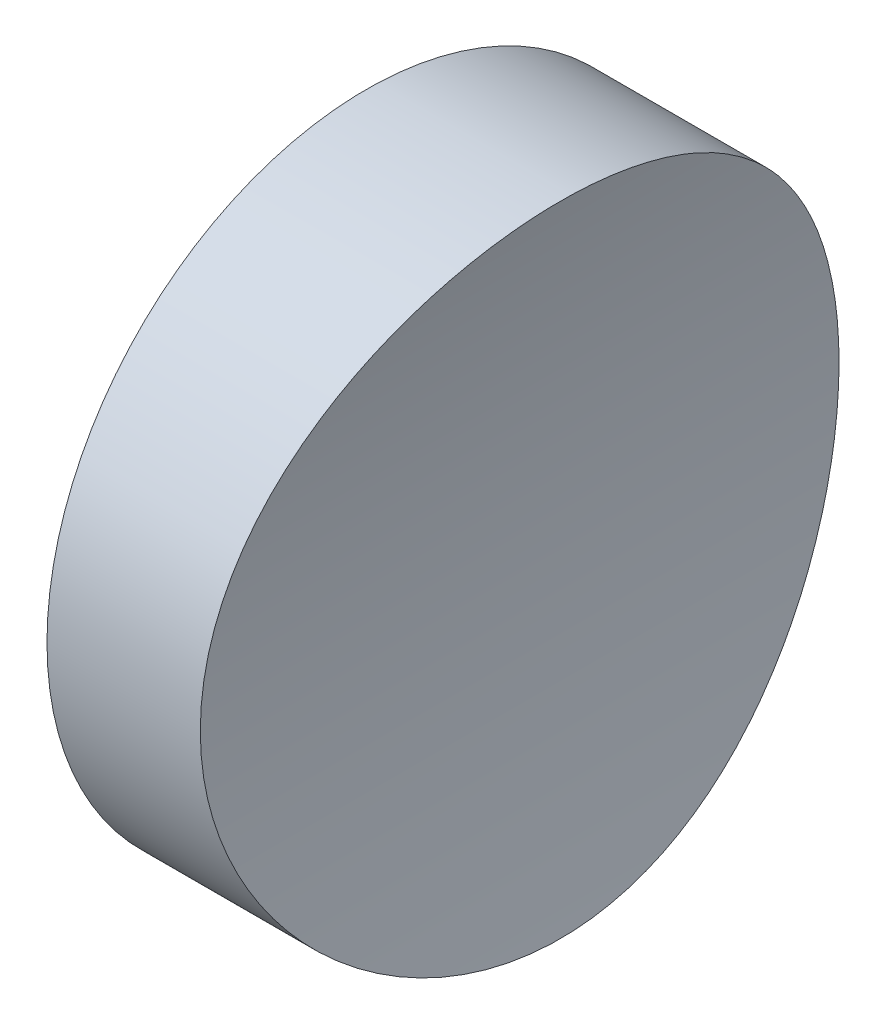
ISO-10303-21;
HEADER;
FILE_DESCRIPTION(('STEP AP214'),'2;1');
FILE_NAME('part.step','',(''),(''),'','','');
FILE_SCHEMA(('AUTOMOTIVE_DESIGN { 1 0 10303 214 1 1 1 1 }'));
ENDSEC;
DATA;
#1=APPLICATION_CONTEXT('core data for automotive mechanical design processes');
#2=APPLICATION_PROTOCOL_DEFINITION('international standard','automotive_design',2000,#1);
#3=PRODUCT_CONTEXT('',#1,'mechanical');
#4=PRODUCT('Part','Part','',(#3));
#5=PRODUCT_RELATED_PRODUCT_CATEGORY('part','',(#4));
#6=PRODUCT_DEFINITION_FORMATION('','',#4);
#7=PRODUCT_DEFINITION_CONTEXT('part definition',#1,'design');
#8=PRODUCT_DEFINITION('design','',#6,#7);
#9=PRODUCT_DEFINITION_SHAPE('','',#8);
#10=(LENGTH_UNIT() NAMED_UNIT(*) SI_UNIT(.MILLI.,.METRE.));
#11=(NAMED_UNIT(*) PLANE_ANGLE_UNIT() SI_UNIT($,.RADIAN.));
#12=(NAMED_UNIT(*) SI_UNIT($,.STERADIAN.) SOLID_ANGLE_UNIT());
#13=UNCERTAINTY_MEASURE_WITH_UNIT(LENGTH_MEASURE(1.E-05),#10,'distance_accuracy_value','');
#14=(GEOMETRIC_REPRESENTATION_CONTEXT(3) GLOBAL_UNCERTAINTY_ASSIGNED_CONTEXT((#13)) GLOBAL_UNIT_ASSIGNED_CONTEXT((#10,
#11,#12)) REPRESENTATION_CONTEXT('',''));
#15=CARTESIAN_POINT('',(0.,0.,0.));
#16=DIRECTION('',(0.,0.,1.));
#17=DIRECTION('',(1.,0.,0.));
#18=AXIS2_PLACEMENT_3D('',#15,#16,#17);
#19=CARTESIAN_POINT('',(10.,0.,0.));
#20=DIRECTION('',(-1.,0.,0.));
#21=DIRECTION('',(0.,0.,1.));
#22=AXIS2_PLACEMENT_3D('',#19,#20,#21);
#23=CYLINDRICAL_SURFACE('',#22,6.25);
#24=CARTESIAN_POINT('',(3.,0.,6.25));
#25=CARTESIAN_POINT('',(2.99999687887849,0.172713945212292,6.25000515518082));
#26=CARTESIAN_POINT('',(3.00179246487053,0.345371477183103,6.24283971365372));
#27=CARTESIAN_POINT('',(3.00891780513268,0.689477439062226,6.21425014373295));
#28=CARTESIAN_POINT('',(3.0142479626321,0.860925728762749,6.19282438849984));
#29=CARTESIAN_POINT('',(3.02830075543672,1.20136946134818,6.13587945896304));
#30=CARTESIAN_POINT('',(3.03702444316566,1.37036412641703,6.1003559124912));
#31=CARTESIAN_POINT('',(3.05762649136016,1.70471874326447,6.01549590844116));
#32=CARTESIAN_POINT('',(3.06950601442701,1.87007733116385,5.96615435998424));
#33=CARTESIAN_POINT('',(3.09607249161212,2.19568636278267,5.85414875180168));
#34=CARTESIAN_POINT('',(3.11075493917529,2.35594453086983,5.79150605981015));
#35=CARTESIAN_POINT('',(3.14254926230046,2.67061066480478,5.65330686435857));
#36=CARTESIAN_POINT('',(3.15966203442203,2.82501644492505,5.57774559305992));
#37=CARTESIAN_POINT('',(3.19584906439531,3.12685063576603,5.41430964049058));
#38=CARTESIAN_POINT('',(3.21492260786275,3.27428155930855,5.32643943963362));
#39=CARTESIAN_POINT('',(3.25453838794393,3.5613388193175,5.13894607855176));
#40=CARTESIAN_POINT('',(3.27508117543988,3.70096219306753,5.03931850078737));
#41=CARTESIAN_POINT('',(3.31746826039777,3.97392119377508,4.82709800286526));
#42=CARTESIAN_POINT('',(3.33932940003407,4.10709696784651,4.71430279942074));
#43=CARTESIAN_POINT('',(3.38341623089172,4.36357017543451,4.47796559050907));
#44=CARTESIAN_POINT('',(3.40564205436205,4.48686392548904,4.35441961321802));
#45=CARTESIAN_POINT('',(3.44983372866334,4.72268218254147,4.09745949656411));
#46=CARTESIAN_POINT('',(3.47179964388925,4.83520940818203,3.96404786353149));
#47=CARTESIAN_POINT('',(3.51487517006676,5.04881579478792,3.68814435777727));
#48=CARTESIAN_POINT('',(3.53598446190267,5.14989071413283,3.54564915108387));
#49=CARTESIAN_POINT('',(3.57703876783404,5.34122478473712,3.25041602713142));
#50=CARTESIAN_POINT('',(3.59696241706534,5.43130551119765,3.0975593968851));
#51=CARTESIAN_POINT('',(3.63472386530711,5.59827186706257,2.78448300924311));
#52=CARTESIAN_POINT('',(3.65256087456142,5.67515250558384,2.62426049574567));
#53=CARTESIAN_POINT('',(3.68559080786454,5.81503975996594,2.29767832302142));
#54=CARTESIAN_POINT('',(3.70078504257876,5.87805325727428,2.13132175583627));
#55=CARTESIAN_POINT('',(3.7280796762319,5.9897526673107,1.79362188637554));
#56=CARTESIAN_POINT('',(3.7401789670557,6.03843344928629,1.6222768224046));
#57=CARTESIAN_POINT('',(3.77078843304884,6.16057455537249,1.10956073690327));
#58=CARTESIAN_POINT('',(3.7843404049328,6.21311443845997,0.762517065548304));
#59=CARTESIAN_POINT('',(3.7933061577325,6.24787342030915,0.239428696499591));
#60=CARTESIAN_POINT('',(3.79439927146835,6.25211107931216,0.0645776279505635));
#61=CARTESIAN_POINT('',(3.79280769880881,6.24594761250791,-0.284870467867756));
#62=CARTESIAN_POINT('',(3.79012297504596,6.23554634190361,-0.459467492607142));
#63=CARTESIAN_POINT('',(3.77669228522052,6.18327826536048,-0.972370585178268));
#64=CARTESIAN_POINT('',(3.76071203618374,6.12091004008673,-1.30867941142709));
#65=CARTESIAN_POINT('',(3.7163891048295,5.94260048938626,-1.9657233940192));
#66=CARTESIAN_POINT('',(3.68804554181417,5.82665534738507,-2.28645743908728));
#67=CARTESIAN_POINT('',(3.62186970794273,5.54328957009819,-2.90722749898246));
#68=CARTESIAN_POINT('',(3.5839445423113,5.37536113457974,-3.20702189754726));
#69=CARTESIAN_POINT('',(3.50292886122239,4.99315112894934,-3.7746651095646));
#70=CARTESIAN_POINT('',(3.45983744248379,4.77886144763182,-4.04250832020862));
#71=CARTESIAN_POINT('',(3.37183826994417,4.30276427540704,-4.54668066590711));
#72=CARTESIAN_POINT('',(3.3269137607873,4.03977607730135,-4.78189342297975));
#73=CARTESIAN_POINT('',(3.24141811184815,3.47754965465509,-5.2050887958842));
#74=CARTESIAN_POINT('',(3.20084710506447,3.17831032324404,-5.39306996903601));
#75=CARTESIAN_POINT('',(3.12842782644213,2.55048287004671,-5.71687736606848));
#76=CARTESIAN_POINT('',(3.09660999382967,2.22179747224855,-5.85252223198522));
#77=CARTESIAN_POINT('',(3.04550345953919,1.5453167000495,-6.06632212619447));
#78=CARTESIAN_POINT('',(3.02621236129032,1.19752499481788,-6.14448815151609));
#79=CARTESIAN_POINT('',(3.00268752994329,0.502249878225548,-6.23940652338218));
#80=CARTESIAN_POINT('',(2.99808110298406,0.154986339085778,-6.25767929429157));
#81=CARTESIAN_POINT('',(3.0033831335688,-0.53763698414067,-6.23646247245937));
#82=CARTESIAN_POINT('',(3.01329028452392,-0.882996936788822,-6.19697807932294));
#83=CARTESIAN_POINT('',(3.04626745013609,-1.55672609861917,-6.0626212895951));
#84=CARTESIAN_POINT('',(3.06914023159366,-1.88527125016613,-5.96857834645498));
#85=CARTESIAN_POINT('',(3.12547056757636,-2.52190546409711,-5.72872020557767));
#86=CARTESIAN_POINT('',(3.15892919102647,-2.82999245687798,-5.58289977933141));
#87=CARTESIAN_POINT('',(3.23361212925936,-3.42301276066118,-5.24068385076954));
#88=CARTESIAN_POINT('',(3.27496370741095,-3.7074382142047,-5.04343683251295));
#89=CARTESIAN_POINT('',(3.36064560285072,-4.23969535048607,-4.60503807849459));
#90=CARTESIAN_POINT('',(3.4049764333793,-4.48752070443369,-4.36387876559849));
#91=CARTESIAN_POINT('',(3.49295954380421,-4.94578972161711,-3.83750701289888));
#92=CARTESIAN_POINT('',(3.53656845882612,-5.15516650497359,-3.55135854980946));
#93=CARTESIAN_POINT('',(3.61696560088788,-5.52297777194849,-2.94689004661777));
#94=CARTESIAN_POINT('',(3.65375413065799,-5.68141451682545,-2.62857143539214));
#95=CARTESIAN_POINT('',(3.70043130774147,-5.8766757365924,-2.13504154269234));
#96=CARTESIAN_POINT('',(3.71454826888015,-5.934605813943,-1.96828825177472));
#97=CARTESIAN_POINT('',(3.73960055726729,-6.03620592925578,-1.63027621906756));
#98=CARTESIAN_POINT('',(3.75053708975468,-6.07988136985139,-1.45901921088166));
#99=CARTESIAN_POINT('',(3.76888377703938,-6.15259372347521,-1.11324692847986));
#100=CARTESIAN_POINT('',(3.77629387220018,-6.18163038894377,-0.938731599213518));
#101=CARTESIAN_POINT('',(3.78735456350746,-6.22481338607339,-0.587752222536388));
#102=CARTESIAN_POINT('',(3.79100533614083,-6.23896041675081,-0.411288266999857));
#103=CARTESIAN_POINT('',(3.79438140738903,-6.25204528422239,-0.0628448490166899));
#104=CARTESIAN_POINT('',(3.79421650846064,-6.25140854730427,0.109117740986596));
#105=CARTESIAN_POINT('',(3.79023579952762,-6.23597475319135,0.452360937663389));
#106=CARTESIAN_POINT('',(3.78642007260676,-6.22117801824283,0.623641559767713));
#107=CARTESIAN_POINT('',(3.77525211236164,-6.17754766155938,0.964313577512693));
#108=CARTESIAN_POINT('',(3.76789933701185,-6.14871188844137,1.13370467952683));
#109=CARTESIAN_POINT('',(3.74988035711208,-6.07725695737972,1.46931006964419));
#110=CARTESIAN_POINT('',(3.73921532037452,-6.03464265714925,1.6355254555268));
#111=CARTESIAN_POINT('',(3.71495398011149,-5.93625212204908,1.96276290242306));
#112=CARTESIAN_POINT('',(3.70137455271062,-5.88055149628393,2.12380897146906));
#113=CARTESIAN_POINT('',(3.67164289641056,-5.7563109675372,2.4405564829032));
#114=CARTESIAN_POINT('',(3.65549156036051,-5.68777551877122,2.59625975734819));
#115=CARTESIAN_POINT('',(3.62105666852736,-5.53832120356287,2.90144452602798));
#116=CARTESIAN_POINT('',(3.60277215504853,-5.45739676992233,3.05092318452306));
#117=CARTESIAN_POINT('',(3.56458427329613,-5.28378202052753,3.34259526730107));
#118=CARTESIAN_POINT('',(3.54468143663888,-5.19109556301266,3.48479105917507));
#119=CARTESIAN_POINT('',(3.5032443400926,-4.99195094092062,3.76473195737883));
#120=CARTESIAN_POINT('',(3.48168084886517,-4.88519329293203,3.90225977418812));
#121=CARTESIAN_POINT('',(3.43801262204269,-4.66067026234,4.16783867545105));
#122=CARTESIAN_POINT('',(3.41590807282749,-4.54290863199716,4.29589296380024));
#123=CARTESIAN_POINT('',(3.37174386845425,-4.29704603694731,4.54182175555663));
#124=CARTESIAN_POINT('',(3.34968424752742,-4.16893900596865,4.65969020116741));
#125=CARTESIAN_POINT('',(3.3062324417537,-3.90332475522303,4.88434237281621));
#126=CARTESIAN_POINT('',(3.28484001694934,-3.76582097312992,4.99113011695291));
#127=CARTESIAN_POINT('',(3.24291027399708,-3.47962694485496,5.19481582702542));
#128=CARTESIAN_POINT('',(3.22239615284705,-3.33077660271356,5.29149381360289));
#129=CARTESIAN_POINT('',(3.18324220228333,-3.02526721726076,5.47190281388958));
#130=CARTESIAN_POINT('',(3.16460168462992,-2.86861107315439,5.55563858784633));
#131=CARTESIAN_POINT('',(3.1297241968332,-2.5485801342231,5.70953071579056));
#132=CARTESIAN_POINT('',(3.11348619136288,-2.38520827244969,5.77969292313773));
#133=CARTESIAN_POINT('',(3.08387191782266,-2.05290626906921,5.90590245363844));
#134=CARTESIAN_POINT('',(3.07049521809824,-1.88397697029587,5.96195190605829));
#135=CARTESIAN_POINT('',(3.0396823366414,-1.43518365075969,6.08982588948369));
#136=CARTESIAN_POINT('',(3.02489429667597,-1.15165778401843,6.14978685191745));
#137=CARTESIAN_POINT('',(3.00505610828172,-0.578701565046397,6.22986809181151));
#138=CARTESIAN_POINT('',(3.00000522744122,-0.289271658562023,6.24999136579444));
#139=CARTESIAN_POINT('',(3.,0.,6.25));
#140=B_SPLINE_CURVE_WITH_KNOTS('',3,(#24,#25,#26,#27,#28,#29,#30,#31,#32,#33,#34,#35,#36,#37,
#38,#39,#40,#41,#42,#43,#44,#45,#46,#47,#48,#49,#50,#51,#52,#53,#54,#55,#56,#57,#58,#59,#60,#61,
#62,#63,#64,#65,#66,#67,#68,#69,#70,#71,#72,#73,#74,#75,#76,#77,#78,#79,#80,#81,#82,#83,#84,#85,
#86,#87,#88,#89,#90,#91,#92,#93,#94,#95,#96,#97,#98,#99,#100,#101,#102,#103,#104,#105,#106,#107,
#108,#109,#110,#111,#112,#113,#114,#115,#116,#117,#118,#119,#120,#121,#122,#123,#124,#125,#126,
#127,#128,#129,#130,#131,#132,#133,#134,#135,#136,#137,#138,#139),.UNSPECIFIED.,.T.,.F.,(4,2,2,
2,2,2,2,2,2,2,2,2,2,2,2,2,2,2,2,2,2,2,2,2,2,2,2,2,2,2,2,2,2,2,2,2,2,2,2,2,2,2,2,2,2,2,2,2,2,2,2,
2,2,2,2,2,2,4),(0.,0.517886930842011,1.03583295318369,1.55393973255113,2.07223764639931,
2.58970915181708,3.10737205349274,3.62484701468604,4.14251702686513,4.66957067536086,
5.19681987487716,5.72393558599022,6.25124589252249,6.78621543582607,7.32138680496869,
7.85629199812451,8.39138844175132,9.43896485557221,9.96315683290583,10.4873539951797,
11.5093731157988,12.5314650516113,13.563874401938,14.5964645253665,15.6584982809022,
16.72056447212,17.7862786159061,18.8517888108865,19.8900319467462,20.928181620224,
21.9509471786112,22.9738160456218,24.014835222416,25.0560341991938,26.1227902907129,
27.1894990217559,27.7202349768929,28.2507695441827,28.7813130831619,29.3118317138634,
29.8271032639039,30.3423630879259,30.8577018967284,31.3728592170866,31.8851102855291,
32.3971839099515,32.9094883223599,33.4216251183441,33.947311711681,34.4728197001647,
34.9986381019406,35.5242651594632,36.0596341752548,36.5948058071005,37.1297461387195,
37.6646057126219,38.5320590093219,39.3994470551923),.UNSPECIFIED.);
#141=CARTESIAN_POINT('',(3.,0.,6.25));
#142=VERTEX_POINT('',#141);
#143=EDGE_CURVE('E10',#142,#142,#140,.T.);
#144=ORIENTED_EDGE('',*,*,#143,.T.);
#145=EDGE_LOOP('',(#144));
#146=FACE_BOUND('',#145,.T.);
#147=CARTESIAN_POINT('',(0.,0.,0.));
#148=DIRECTION('',(1.,0.,0.));
#149=DIRECTION('',(0.,0.,-1.));
#150=AXIS2_PLACEMENT_3D('',#147,#148,#149);
#151=CIRCLE('',#150,6.25);
#152=CARTESIAN_POINT('',(0.,0.,-6.25));
#153=VERTEX_POINT('',#152);
#154=EDGE_CURVE('E46',#153,#153,#151,.T.);
#155=ORIENTED_EDGE('',*,*,#154,.T.);
#156=EDGE_LOOP('',(#155));
#157=FACE_BOUND('',#156,.T.);
#158=ADVANCED_FACE('F35',(#146,#157),#23,.T.);
#159=CARTESIAN_POINT('',(0.,0.,0.));
#160=DIRECTION('',(1.,0.,0.));
#161=DIRECTION('',(0.,0.,-1.));
#162=AXIS2_PLACEMENT_3D('',#159,#160,#161);
#163=PLANE('',#162);
#164=ORIENTED_EDGE('',*,*,#154,.F.);
#165=EDGE_LOOP('',(#164));
#166=FACE_BOUND('',#165,.T.);
#167=ADVANCED_FACE('F53',(#166),#163,.F.);
#168=CARTESIAN_POINT('',(28.,0.,-6.25));
#169=DIRECTION('',(0.,0.,1.));
#170=DIRECTION('',(1.,0.,0.));
#171=AXIS2_PLACEMENT_3D('',#168,#169,#170);
#172=CYLINDRICAL_SURFACE('',#171,25.);
#173=ORIENTED_EDGE('',*,*,#143,.F.);
#174=EDGE_LOOP('',(#173));
#175=FACE_BOUND('',#174,.T.);
#176=ADVANCED_FACE('F55',(#175),#172,.F.);
#177=CLOSED_SHELL('',(#158,#167,#176));
#178=MANIFOLD_SOLID_BREP('B2',#177);
#179=ADVANCED_BREP_SHAPE_REPRESENTATION('',(#18,#178),#14);
#180=SHAPE_DEFINITION_REPRESENTATION(#9,#179);
ENDSEC;
END-ISO-10303-21;
